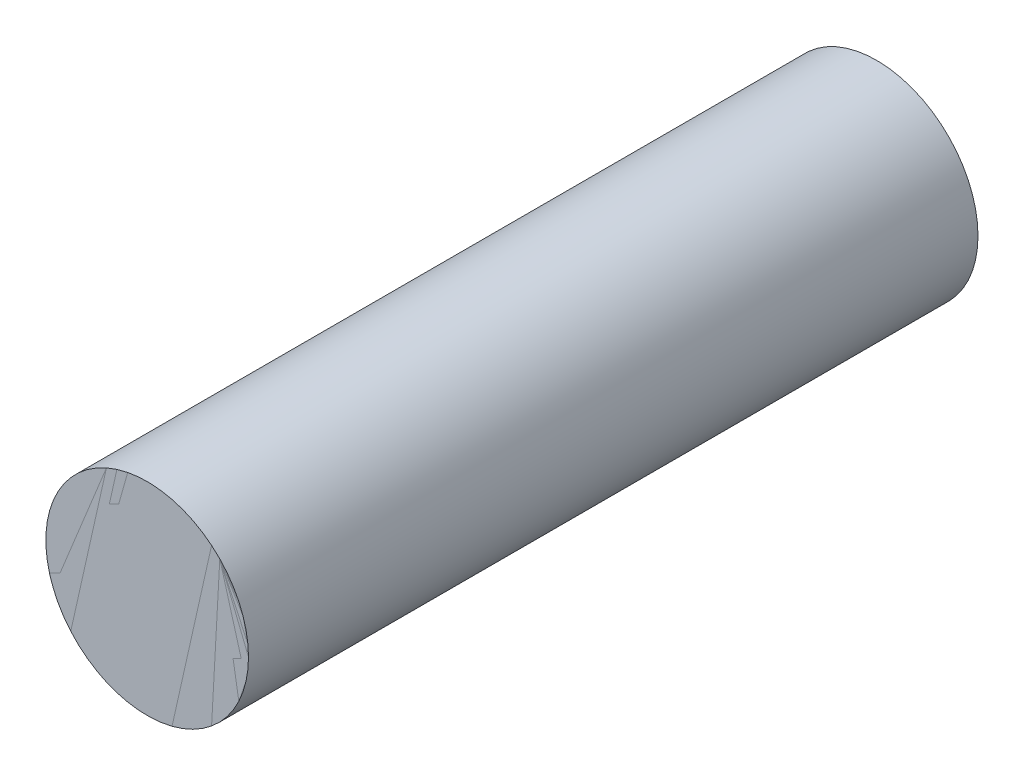
ISO-10303-21;
HEADER;
FILE_DESCRIPTION(('STEP AP214'),'2;1');
FILE_NAME('part.step','',(''),(''),'','','');
FILE_SCHEMA(('AUTOMOTIVE_DESIGN { 1 0 10303 214 1 1 1 1 }'));
ENDSEC;
DATA;
#1=APPLICATION_CONTEXT('core data for automotive mechanical design processes');
#2=APPLICATION_PROTOCOL_DEFINITION('international standard','automotive_design',2000,#1);
#3=PRODUCT_CONTEXT('',#1,'mechanical');
#4=PRODUCT('Part','Part','',(#3));
#5=PRODUCT_RELATED_PRODUCT_CATEGORY('part','',(#4));
#6=PRODUCT_DEFINITION_FORMATION('','',#4);
#7=PRODUCT_DEFINITION_CONTEXT('part definition',#1,'design');
#8=PRODUCT_DEFINITION('design','',#6,#7);
#9=PRODUCT_DEFINITION_SHAPE('','',#8);
#10=(LENGTH_UNIT() NAMED_UNIT(*) SI_UNIT(.MILLI.,.METRE.));
#11=(NAMED_UNIT(*) PLANE_ANGLE_UNIT() SI_UNIT($,.RADIAN.));
#12=(NAMED_UNIT(*) SI_UNIT($,.STERADIAN.) SOLID_ANGLE_UNIT());
#13=UNCERTAINTY_MEASURE_WITH_UNIT(LENGTH_MEASURE(1.E-05),#10,'distance_accuracy_value','');
#14=(GEOMETRIC_REPRESENTATION_CONTEXT(3) GLOBAL_UNCERTAINTY_ASSIGNED_CONTEXT((#13)) GLOBAL_UNIT_ASSIGNED_CONTEXT((#10,
#11,#12)) REPRESENTATION_CONTEXT('',''));
#15=CARTESIAN_POINT('',(0.,0.,0.));
#16=DIRECTION('',(0.,0.,1.));
#17=DIRECTION('',(1.,0.,0.));
#18=AXIS2_PLACEMENT_3D('',#15,#16,#17);
#19=CARTESIAN_POINT('',(-110.435261655171,-74.8999546142995,-1.8));
#20=DIRECTION('',(0.,0.,1.));
#21=DIRECTION('',(1.,0.,0.));
#22=AXIS2_PLACEMENT_3D('',#19,#20,#21);
#23=CYLINDRICAL_SURFACE('',#22,0.25);
#24=CARTESIAN_POINT('',(-110.435261655171,-74.8999546142995,-1.8));
#25=DIRECTION('',(0.,0.,1.));
#26=DIRECTION('',(1.,0.,0.));
#27=AXIS2_PLACEMENT_3D('',#24,#25,#26);
#28=CIRCLE('',#27,0.25);
#29=CARTESIAN_POINT('',(-110.185261655171,-74.8999546142995,-1.8));
#30=VERTEX_POINT('',#29);
#31=EDGE_CURVE('E11',#30,#30,#28,.T.);
#32=ORIENTED_EDGE('',*,*,#31,.T.);
#33=EDGE_LOOP('',(#32));
#34=FACE_BOUND('',#33,.T.);
#35=CARTESIAN_POINT('',(-110.435261655171,-74.8999546142995,0.));
#36=DIRECTION('',(0.,0.,1.));
#37=DIRECTION('',(1.,0.,0.));
#38=AXIS2_PLACEMENT_3D('',#35,#36,#37);
#39=CIRCLE('',#38,0.25);
#40=CARTESIAN_POINT('',(-110.185261655171,-74.8999546142995,0.));
#41=VERTEX_POINT('',#40);
#42=EDGE_CURVE('E46',#41,#41,#39,.T.);
#43=ORIENTED_EDGE('',*,*,#42,.F.);
#44=EDGE_LOOP('',(#43));
#45=FACE_BOUND('',#44,.T.);
#46=ADVANCED_FACE('F43',(#34,#45),#23,.T.);
#47=CARTESIAN_POINT('',(-110.435261655171,-74.8999546142995,-1.8));
#48=DIRECTION('',(0.,0.,1.));
#49=DIRECTION('',(1.,0.,0.));
#50=AXIS2_PLACEMENT_3D('',#47,#48,#49);
#51=PLANE('',#50);
#52=ORIENTED_EDGE('',*,*,#31,.F.);
#53=EDGE_LOOP('',(#52));
#54=FACE_BOUND('',#53,.T.);
#55=ADVANCED_FACE('F58',(#54),#51,.F.);
#56=CARTESIAN_POINT('',(-110.435261655171,-74.8999546142995,0.));
#57=DIRECTION('',(0.,0.,1.));
#58=DIRECTION('',(1.,0.,0.));
#59=AXIS2_PLACEMENT_3D('',#56,#57,#58);
#60=PLANE('',#59);
#61=ORIENTED_EDGE('',*,*,#42,.T.);
#62=EDGE_LOOP('',(#61));
#63=FACE_BOUND('',#62,.T.);
#64=ADVANCED_FACE('F55',(#63),#60,.T.);
#65=CLOSED_SHELL('',(#46,#55,#64));
#66=MANIFOLD_SOLID_BREP('B2',#65);
#67=CARTESIAN_POINT('',(-110.435261655171,-74.8999546142995,0.));
#68=DIRECTION('',(0.,0.,1.));
#69=DIRECTION('',(1.,0.,0.));
#70=AXIS2_PLACEMENT_3D('',#67,#68,#69);
#71=PLANE('',#70);
#72=CARTESIAN_POINT('',(-110.435261655171,-74.8999546142995,0.));
#73=DIRECTION('',(0.,0.,1.));
#74=DIRECTION('',(1.,0.,0.));
#75=AXIS2_PLACEMENT_3D('',#72,#73,#74);
#76=CIRCLE('',#75,0.25);
#77=CARTESIAN_POINT('',(-110.185261655171,-74.8999546142995,0.));
#78=VERTEX_POINT('',#77);
#79=EDGE_CURVE('E42',#78,#78,#76,.F.);
#80=ORIENTED_EDGE('',*,*,#79,.F.);
#81=EDGE_LOOP('',(#80));
#82=FACE_BOUND('',#81,.T.);
#83=ADVANCED_FACE('F83',(#82),#71,.T.);
#84=OPEN_SHELL('',(#83));
#85=SHELL_BASED_SURFACE_MODEL('B6',(#84));
#86=ADVANCED_BREP_SHAPE_REPRESENTATION('',(#18,#66),#14);
#87=MANIFOLD_SURFACE_SHAPE_REPRESENTATION('',(#18,#85),#14);
#88=SHAPE_REPRESENTATION('',(#18),#14);
#89=SHAPE_DEFINITION_REPRESENTATION(#9,#88);
#90=SHAPE_REPRESENTATION_RELATIONSHIP('','',#88,#86);
#91=SHAPE_REPRESENTATION_RELATIONSHIP('','',#88,#87);
ENDSEC;
END-ISO-10303-21;
